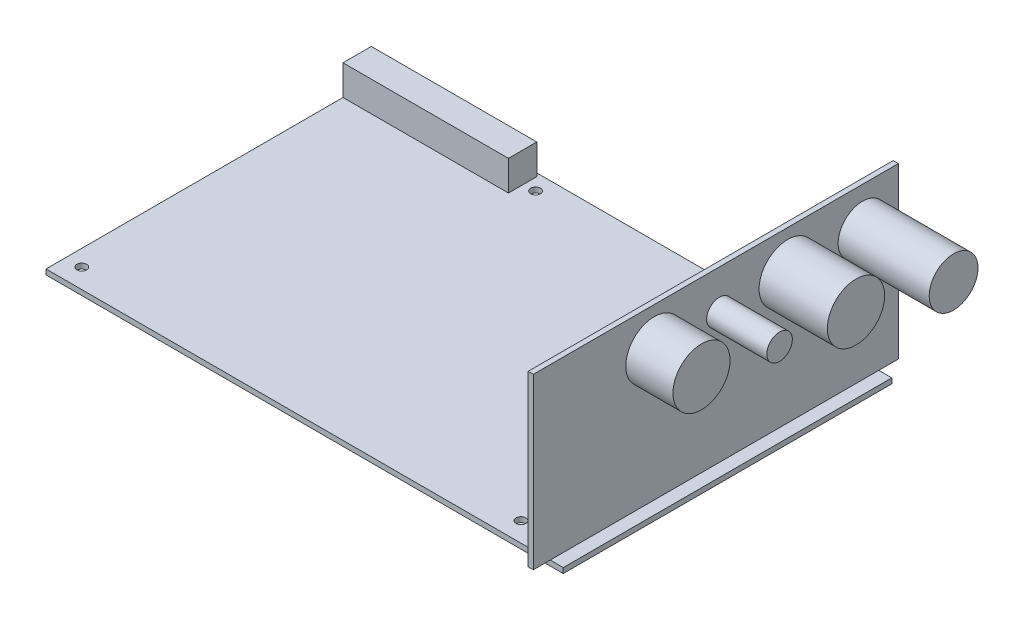
ISO-10303-21;
HEADER;
FILE_DESCRIPTION(('STEP AP214'),'2;1');
FILE_NAME('part.step','',(''),(''),'','','');
FILE_SCHEMA(('AUTOMOTIVE_DESIGN { 1 0 10303 214 1 1 1 1 }'));
ENDSEC;
DATA;
#1=APPLICATION_CONTEXT('core data for automotive mechanical design processes');
#2=APPLICATION_PROTOCOL_DEFINITION('international standard','automotive_design',2000,#1);
#3=PRODUCT_CONTEXT('',#1,'mechanical');
#4=PRODUCT('Part','Part','',(#3));
#5=PRODUCT_RELATED_PRODUCT_CATEGORY('part','',(#4));
#6=PRODUCT_DEFINITION_FORMATION('','',#4);
#7=PRODUCT_DEFINITION_CONTEXT('part definition',#1,'design');
#8=PRODUCT_DEFINITION('design','',#6,#7);
#9=PRODUCT_DEFINITION_SHAPE('','',#8);
#10=(LENGTH_UNIT() NAMED_UNIT(*) SI_UNIT(.MILLI.,.METRE.));
#11=(NAMED_UNIT(*) PLANE_ANGLE_UNIT() SI_UNIT($,.RADIAN.));
#12=(NAMED_UNIT(*) SI_UNIT($,.STERADIAN.) SOLID_ANGLE_UNIT());
#13=UNCERTAINTY_MEASURE_WITH_UNIT(LENGTH_MEASURE(1.E-05),#10,'distance_accuracy_value','');
#14=(GEOMETRIC_REPRESENTATION_CONTEXT(3) GLOBAL_UNCERTAINTY_ASSIGNED_CONTEXT((#13)) GLOBAL_UNIT_ASSIGNED_CONTEXT((#10,
#11,#12)) REPRESENTATION_CONTEXT('',''));
#15=CARTESIAN_POINT('',(0.,0.,0.));
#16=DIRECTION('',(0.,0.,1.));
#17=DIRECTION('',(1.,0.,0.));
#18=AXIS2_PLACEMENT_3D('',#15,#16,#17);
#19=CARTESIAN_POINT('',(0.,1.6,0.));
#20=DIRECTION('',(0.,1.,0.));
#21=DIRECTION('',(0.,0.,1.));
#22=AXIS2_PLACEMENT_3D('',#19,#20,#21);
#23=PLANE('',#22);
#24=CARTESIAN_POINT('',(-74.5,1.6,44.5));
#25=DIRECTION('',(0.,1.,0.));
#26=DIRECTION('',(0.,0.,1.));
#27=AXIS2_PLACEMENT_3D('',#24,#25,#26);
#28=CIRCLE('',#27,1.5);
#29=CARTESIAN_POINT('',(-74.5,1.6,46.));
#30=VERTEX_POINT('',#29);
#31=EDGE_CURVE('E418',#30,#30,#28,.T.);
#32=ORIENTED_EDGE('',*,*,#31,.F.);
#33=EDGE_LOOP('',(#32));
#34=FACE_BOUND('',#33,.T.);
#35=CARTESIAN_POINT('',(-25.,1.6,-45.5));
#36=DIRECTION('',(0.,1.,0.));
#37=DIRECTION('',(0.,0.,1.));
#38=AXIS2_PLACEMENT_3D('',#35,#36,#37);
#39=CIRCLE('',#38,1.5);
#40=CARTESIAN_POINT('',(-25.,1.6,-44.));
#41=VERTEX_POINT('',#40);
#42=EDGE_CURVE('E342',#41,#41,#39,.T.);
#43=ORIENTED_EDGE('',*,*,#42,.F.);
#44=EDGE_LOOP('',(#43));
#45=FACE_BOUND('',#44,.T.);
#46=CARTESIAN_POINT('',(30.5,1.6,-40.5));
#47=DIRECTION('',(0.,1.,0.));
#48=DIRECTION('',(0.,0.,1.));
#49=AXIS2_PLACEMENT_3D('',#46,#47,#48);
#50=CIRCLE('',#49,1.5);
#51=CARTESIAN_POINT('',(30.5,1.6,-39.));
#52=VERTEX_POINT('',#51);
#53=EDGE_CURVE('E349',#52,#52,#50,.T.);
#54=ORIENTED_EDGE('',*,*,#53,.F.);
#55=EDGE_LOOP('',(#54));
#56=FACE_BOUND('',#55,.T.);
#57=CARTESIAN_POINT('',(60.5,1.6,44.5));
#58=DIRECTION('',(0.,1.,0.));
#59=DIRECTION('',(0.,0.,1.));
#60=AXIS2_PLACEMENT_3D('',#57,#58,#59);
#61=CIRCLE('',#60,1.5);
#62=CARTESIAN_POINT('',(60.5,1.6,46.));
#63=VERTEX_POINT('',#62);
#64=EDGE_CURVE('E423',#63,#63,#61,.T.);
#65=ORIENTED_EDGE('',*,*,#64,.F.);
#66=EDGE_LOOP('',(#65));
#67=FACE_BOUND('',#66,.T.);
#68=DIRECTION('',(1.,0.,0.));
#69=VECTOR('',#68,1.);
#70=CARTESIAN_POINT('',(-79.5,1.6,50.5));
#71=LINE('',#70,#69);
#72=CARTESIAN_POINT('',(-79.5,1.6,50.5));
#73=VERTEX_POINT('',#72);
#74=CARTESIAN_POINT('',(73.8999999999999,1.6,50.5));
#75=VERTEX_POINT('',#74);
#76=EDGE_CURVE('E327',#73,#75,#71,.T.);
#77=ORIENTED_EDGE('',*,*,#76,.T.);
#78=DIRECTION('',(0.,0.,1.));
#79=VECTOR('',#78,1.);
#80=CARTESIAN_POINT('',(73.8999999999999,1.6,-56.5));
#81=LINE('',#80,#79);
#82=CARTESIAN_POINT('',(73.8999999999999,1.6,-50.5));
#83=VERTEX_POINT('',#82);
#84=EDGE_CURVE('E48',#83,#75,#81,.T.);
#85=ORIENTED_EDGE('',*,*,#84,.F.);
#86=DIRECTION('',(-1.,0.,0.));
#87=VECTOR('',#86,1.);
#88=CARTESIAN_POINT('',(-79.5,1.6,-50.5));
#89=LINE('',#88,#87);
#90=CARTESIAN_POINT('',(-79.5,1.6,-50.5));
#91=VERTEX_POINT('',#90);
#92=EDGE_CURVE('E355',#83,#91,#89,.T.);
#93=ORIENTED_EDGE('',*,*,#92,.T.);
#94=DIRECTION('',(0.,0.,1.));
#95=VECTOR('',#94,1.);
#96=CARTESIAN_POINT('',(-79.5,1.6,-50.5));
#97=LINE('',#96,#95);
#98=CARTESIAN_POINT('',(-79.5,1.6,-49.5));
#99=VERTEX_POINT('',#98);
#100=EDGE_CURVE('E313',#91,#99,#97,.T.);
#101=ORIENTED_EDGE('',*,*,#100,.T.);
#102=DIRECTION('',(-1.,0.,0.));
#103=VECTOR('',#102,1.);
#104=CARTESIAN_POINT('',(-79.5,1.6,-49.5));
#105=LINE('',#104,#103);
#106=CARTESIAN_POINT('',(-28.63,1.6,-49.5));
#107=VERTEX_POINT('',#106);
#108=EDGE_CURVE('E172',#107,#99,#105,.T.);
#109=ORIENTED_EDGE('',*,*,#108,.F.);
#110=DIRECTION('',(0.,0.,-1.));
#111=VECTOR('',#110,1.);
#112=CARTESIAN_POINT('',(-28.63,1.6,-49.5));
#113=LINE('',#112,#111);
#114=CARTESIAN_POINT('',(-28.63,1.6,-40.79));
#115=VERTEX_POINT('',#114);
#116=EDGE_CURVE('E179',#115,#107,#113,.T.);
#117=ORIENTED_EDGE('',*,*,#116,.F.);
#118=DIRECTION('',(1.,0.,0.));
#119=VECTOR('',#118,1.);
#120=CARTESIAN_POINT('',(-79.5,1.6,-40.79));
#121=LINE('',#120,#119);
#122=CARTESIAN_POINT('',(-79.5,1.6,-40.79));
#123=VERTEX_POINT('',#122);
#124=EDGE_CURVE('E162',#123,#115,#121,.T.);
#125=ORIENTED_EDGE('',*,*,#124,.F.);
#126=EDGE_CURVE('E333',#123,#73,#97,.T.);
#127=ORIENTED_EDGE('',*,*,#126,.T.);
#128=EDGE_LOOP('',(#77,#85,#93,#101,#109,#117,#125,#127));
#129=FACE_BOUND('',#128,.T.);
#130=ADVANCED_FACE('F33',(#34,#45,#56,#67,#129),#23,.T.);
#131=CARTESIAN_POINT('',(79.5,1.6,-50.5));
#132=VERTEX_POINT('',#131);
#133=CARTESIAN_POINT('',(75.4999999999999,1.6,-50.5));
#134=VERTEX_POINT('',#133);
#135=EDGE_CURVE('E338',#132,#134,#89,.T.);
#136=ORIENTED_EDGE('',*,*,#135,.T.);
#137=DIRECTION('',(0.,0.,-1.));
#138=VECTOR('',#137,1.);
#139=CARTESIAN_POINT('',(75.5,1.6,-56.5));
#140=LINE('',#139,#138);
#141=CARTESIAN_POINT('',(75.5,1.6,50.5));
#142=VERTEX_POINT('',#141);
#143=EDGE_CURVE('E222',#142,#134,#140,.T.);
#144=ORIENTED_EDGE('',*,*,#143,.F.);
#145=CARTESIAN_POINT('',(79.5,1.6,50.5));
#146=VERTEX_POINT('',#145);
#147=EDGE_CURVE('E332',#142,#146,#71,.T.);
#148=ORIENTED_EDGE('',*,*,#147,.T.);
#149=DIRECTION('',(0.,0.,-1.));
#150=VECTOR('',#149,1.);
#151=CARTESIAN_POINT('',(79.5,1.6,-50.5));
#152=LINE('',#151,#150);
#153=EDGE_CURVE('E320',#146,#132,#152,.T.);
#154=ORIENTED_EDGE('',*,*,#153,.T.);
#155=EDGE_LOOP('',(#136,#144,#148,#154));
#156=FACE_BOUND('',#155,.T.);
#157=ADVANCED_FACE('F268',(#156),#23,.T.);
#158=CARTESIAN_POINT('',(0.,0.,0.));
#159=DIRECTION('',(0.,1.,0.));
#160=DIRECTION('',(0.,0.,1.));
#161=AXIS2_PLACEMENT_3D('',#158,#159,#160);
#162=PLANE('',#161);
#163=DIRECTION('',(0.,0.,-1.));
#164=VECTOR('',#163,1.);
#165=CARTESIAN_POINT('',(79.5,0.,-50.5));
#166=LINE('',#165,#164);
#167=CARTESIAN_POINT('',(79.5,0.,50.5));
#168=VERTEX_POINT('',#167);
#169=CARTESIAN_POINT('',(79.5,0.,-50.5));
#170=VERTEX_POINT('',#169);
#171=EDGE_CURVE('E309',#168,#170,#166,.T.);
#172=ORIENTED_EDGE('',*,*,#171,.F.);
#173=DIRECTION('',(1.,0.,0.));
#174=VECTOR('',#173,1.);
#175=CARTESIAN_POINT('',(-79.5,0.,50.5));
#176=LINE('',#175,#174);
#177=CARTESIAN_POINT('',(-79.5,0.,50.5));
#178=VERTEX_POINT('',#177);
#179=EDGE_CURVE('E318',#178,#168,#176,.T.);
#180=ORIENTED_EDGE('',*,*,#179,.F.);
#181=DIRECTION('',(0.,0.,1.));
#182=VECTOR('',#181,1.);
#183=CARTESIAN_POINT('',(-79.5,0.,-50.5));
#184=LINE('',#183,#182);
#185=CARTESIAN_POINT('',(-79.5,0.,-50.5));
#186=VERTEX_POINT('',#185);
#187=EDGE_CURVE('E308',#186,#178,#184,.T.);
#188=ORIENTED_EDGE('',*,*,#187,.F.);
#189=DIRECTION('',(-1.,0.,0.));
#190=VECTOR('',#189,1.);
#191=CARTESIAN_POINT('',(-79.5,0.,-50.5));
#192=LINE('',#191,#190);
#193=EDGE_CURVE('E300',#170,#186,#192,.T.);
#194=ORIENTED_EDGE('',*,*,#193,.F.);
#195=EDGE_LOOP('',(#172,#180,#188,#194));
#196=FACE_BOUND('',#195,.T.);
#197=CARTESIAN_POINT('',(-25.,0.,-45.5));
#198=DIRECTION('',(0.,1.,0.));
#199=DIRECTION('',(0.,0.,1.));
#200=AXIS2_PLACEMENT_3D('',#197,#198,#199);
#201=CIRCLE('',#200,1.5);
#202=CARTESIAN_POINT('',(-25.,0.,-44.));
#203=VERTEX_POINT('',#202);
#204=EDGE_CURVE('E344',#203,#203,#201,.T.);
#205=ORIENTED_EDGE('',*,*,#204,.T.);
#206=EDGE_LOOP('',(#205));
#207=FACE_BOUND('',#206,.T.);
#208=CARTESIAN_POINT('',(30.5,0.,-40.5));
#209=DIRECTION('',(0.,1.,0.));
#210=DIRECTION('',(0.,0.,1.));
#211=AXIS2_PLACEMENT_3D('',#208,#209,#210);
#212=CIRCLE('',#211,1.5);
#213=CARTESIAN_POINT('',(30.5,0.,-39.));
#214=VERTEX_POINT('',#213);
#215=EDGE_CURVE('E352',#214,#214,#212,.T.);
#216=ORIENTED_EDGE('',*,*,#215,.T.);
#217=EDGE_LOOP('',(#216));
#218=FACE_BOUND('',#217,.T.);
#219=CARTESIAN_POINT('',(-74.5,0.,44.5));
#220=DIRECTION('',(0.,1.,0.));
#221=DIRECTION('',(0.,0.,1.));
#222=AXIS2_PLACEMENT_3D('',#219,#220,#221);
#223=CIRCLE('',#222,1.5);
#224=CARTESIAN_POINT('',(-74.5,0.,46.));
#225=VERTEX_POINT('',#224);
#226=EDGE_CURVE('E420',#225,#225,#223,.T.);
#227=ORIENTED_EDGE('',*,*,#226,.T.);
#228=EDGE_LOOP('',(#227));
#229=FACE_BOUND('',#228,.T.);
#230=CARTESIAN_POINT('',(60.5,0.,44.5));
#231=DIRECTION('',(0.,1.,0.));
#232=DIRECTION('',(0.,0.,1.));
#233=AXIS2_PLACEMENT_3D('',#230,#231,#232);
#234=CIRCLE('',#233,1.5);
#235=CARTESIAN_POINT('',(60.5,0.,46.));
#236=VERTEX_POINT('',#235);
#237=EDGE_CURVE('E426',#236,#236,#234,.T.);
#238=ORIENTED_EDGE('',*,*,#237,.T.);
#239=EDGE_LOOP('',(#238));
#240=FACE_BOUND('',#239,.T.);
#241=ADVANCED_FACE('F274',(#196,#207,#218,#229,#240),#162,.F.);
#242=CARTESIAN_POINT('',(79.5,1.6,-50.5));
#243=DIRECTION('',(-1.,0.,0.));
#244=DIRECTION('',(0.,0.,1.));
#245=AXIS2_PLACEMENT_3D('',#242,#243,#244);
#246=PLANE('',#245);
#247=ORIENTED_EDGE('',*,*,#171,.T.);
#248=DIRECTION('',(0.,-1.,0.));
#249=VECTOR('',#248,1.);
#250=CARTESIAN_POINT('',(79.5,1.6,-50.5));
#251=LINE('',#250,#249);
#252=EDGE_CURVE('E200',#132,#170,#251,.T.);
#253=ORIENTED_EDGE('',*,*,#252,.F.);
#254=ORIENTED_EDGE('',*,*,#153,.F.);
#255=DIRECTION('',(0.,-1.,0.));
#256=VECTOR('',#255,1.);
#257=CARTESIAN_POINT('',(79.5,1.6,50.5));
#258=LINE('',#257,#256);
#259=EDGE_CURVE('E324',#146,#168,#258,.T.);
#260=ORIENTED_EDGE('',*,*,#259,.T.);
#261=EDGE_LOOP('',(#247,#253,#254,#260));
#262=FACE_BOUND('',#261,.T.);
#263=ADVANCED_FACE('F35',(#262),#246,.F.);
#264=CARTESIAN_POINT('',(-79.5,1.6,-50.5));
#265=DIRECTION('',(0.,0.,1.));
#266=DIRECTION('',(1.,0.,0.));
#267=AXIS2_PLACEMENT_3D('',#264,#265,#266);
#268=PLANE('',#267);
#269=ORIENTED_EDGE('',*,*,#193,.T.);
#270=DIRECTION('',(0.,-1.,0.));
#271=VECTOR('',#270,1.);
#272=CARTESIAN_POINT('',(-79.5,1.6,-50.5));
#273=LINE('',#272,#271);
#274=EDGE_CURVE('E302',#91,#186,#273,.T.);
#275=ORIENTED_EDGE('',*,*,#274,.F.);
#276=ORIENTED_EDGE('',*,*,#92,.F.);
#277=DIRECTION('',(-1.,0.,0.));
#278=VECTOR('',#277,1.);
#279=CARTESIAN_POINT('',(-79.5,1.6,-50.5));
#280=LINE('',#279,#278);
#281=EDGE_CURVE('E55',#134,#83,#280,.T.);
#282=ORIENTED_EDGE('',*,*,#281,.F.);
#283=ORIENTED_EDGE('',*,*,#135,.F.);
#284=ORIENTED_EDGE('',*,*,#252,.T.);
#285=EDGE_LOOP('',(#269,#275,#276,#282,#283,#284));
#286=FACE_BOUND('',#285,.T.);
#287=ADVANCED_FACE('F291',(#286),#268,.F.);
#288=CARTESIAN_POINT('',(-79.5,1.6,-50.5));
#289=DIRECTION('',(1.,0.,0.));
#290=DIRECTION('',(0.,0.,-1.));
#291=AXIS2_PLACEMENT_3D('',#288,#289,#290);
#292=PLANE('',#291);
#293=ORIENTED_EDGE('',*,*,#187,.T.);
#294=DIRECTION('',(0.,-1.,0.));
#295=VECTOR('',#294,1.);
#296=CARTESIAN_POINT('',(-79.5,1.6,50.5));
#297=LINE('',#296,#295);
#298=EDGE_CURVE('E314',#73,#178,#297,.T.);
#299=ORIENTED_EDGE('',*,*,#298,.F.);
#300=ORIENTED_EDGE('',*,*,#126,.F.);
#301=DIRECTION('',(0.,-1.,0.));
#302=VECTOR('',#301,1.);
#303=CARTESIAN_POINT('',(-79.5,10.84,-40.79));
#304=LINE('',#303,#302);
#305=CARTESIAN_POINT('',(-79.5,10.84,-40.79));
#306=VERTEX_POINT('',#305);
#307=EDGE_CURVE('E429',#306,#123,#304,.T.);
#308=ORIENTED_EDGE('',*,*,#307,.F.);
#309=DIRECTION('',(0.,0.,1.));
#310=VECTOR('',#309,1.);
#311=CARTESIAN_POINT('',(-79.5,10.84,-49.5));
#312=LINE('',#311,#310);
#313=CARTESIAN_POINT('',(-79.5,10.84,-49.5));
#314=VERTEX_POINT('',#313);
#315=EDGE_CURVE('E168',#314,#306,#312,.T.);
#316=ORIENTED_EDGE('',*,*,#315,.F.);
#317=DIRECTION('',(0.,-1.,0.));
#318=VECTOR('',#317,1.);
#319=CARTESIAN_POINT('',(-79.5,10.84,-49.5));
#320=LINE('',#319,#318);
#321=EDGE_CURVE('E178',#314,#99,#320,.T.);
#322=ORIENTED_EDGE('',*,*,#321,.T.);
#323=ORIENTED_EDGE('',*,*,#100,.F.);
#324=ORIENTED_EDGE('',*,*,#274,.T.);
#325=EDGE_LOOP('',(#293,#299,#300,#308,#316,#322,#323,#324));
#326=FACE_BOUND('',#325,.T.);
#327=ADVANCED_FACE('F288',(#326),#292,.F.);
#328=CARTESIAN_POINT('',(-79.5,1.6,50.5));
#329=DIRECTION('',(0.,0.,-1.));
#330=DIRECTION('',(-1.,0.,0.));
#331=AXIS2_PLACEMENT_3D('',#328,#329,#330);
#332=PLANE('',#331);
#333=ORIENTED_EDGE('',*,*,#179,.T.);
#334=ORIENTED_EDGE('',*,*,#259,.F.);
#335=ORIENTED_EDGE('',*,*,#147,.F.);
#336=EDGE_CURVE('E341',#75,#142,#71,.T.);
#337=ORIENTED_EDGE('',*,*,#336,.F.);
#338=ORIENTED_EDGE('',*,*,#76,.F.);
#339=ORIENTED_EDGE('',*,*,#298,.T.);
#340=EDGE_LOOP('',(#333,#334,#335,#337,#338,#339));
#341=FACE_BOUND('',#340,.T.);
#342=ADVANCED_FACE('F285',(#341),#332,.F.);
#343=CARTESIAN_POINT('',(-25.,1.6,-45.5));
#344=DIRECTION('',(0.,-1.,0.));
#345=DIRECTION('',(0.,0.,-1.));
#346=AXIS2_PLACEMENT_3D('',#343,#344,#345);
#347=CYLINDRICAL_SURFACE('',#346,1.5);
#348=ORIENTED_EDGE('',*,*,#42,.T.);
#349=EDGE_LOOP('',(#348));
#350=FACE_BOUND('',#349,.T.);
#351=ORIENTED_EDGE('',*,*,#204,.F.);
#352=EDGE_LOOP('',(#351));
#353=FACE_BOUND('',#352,.T.);
#354=ADVANCED_FACE('F280',(#350,#353),#347,.F.);
#355=CARTESIAN_POINT('',(30.5,1.6,-40.5));
#356=DIRECTION('',(0.,-1.,0.));
#357=DIRECTION('',(0.,0.,-1.));
#358=AXIS2_PLACEMENT_3D('',#355,#356,#357);
#359=CYLINDRICAL_SURFACE('',#358,1.5);
#360=ORIENTED_EDGE('',*,*,#53,.T.);
#361=EDGE_LOOP('',(#360));
#362=FACE_BOUND('',#361,.T.);
#363=ORIENTED_EDGE('',*,*,#215,.F.);
#364=EDGE_LOOP('',(#363));
#365=FACE_BOUND('',#364,.T.);
#366=ADVANCED_FACE('F405',(#362,#365),#359,.F.);
#367=CARTESIAN_POINT('',(-74.5,1.6,44.5));
#368=DIRECTION('',(0.,-1.,0.));
#369=DIRECTION('',(0.,0.,-1.));
#370=AXIS2_PLACEMENT_3D('',#367,#368,#369);
#371=CYLINDRICAL_SURFACE('',#370,1.5);
#372=ORIENTED_EDGE('',*,*,#31,.T.);
#373=EDGE_LOOP('',(#372));
#374=FACE_BOUND('',#373,.T.);
#375=ORIENTED_EDGE('',*,*,#226,.F.);
#376=EDGE_LOOP('',(#375));
#377=FACE_BOUND('',#376,.T.);
#378=ADVANCED_FACE('F402',(#374,#377),#371,.F.);
#379=CARTESIAN_POINT('',(60.5,1.6,44.5));
#380=DIRECTION('',(0.,-1.,0.));
#381=DIRECTION('',(0.,0.,-1.));
#382=AXIS2_PLACEMENT_3D('',#379,#380,#381);
#383=CYLINDRICAL_SURFACE('',#382,1.5);
#384=ORIENTED_EDGE('',*,*,#64,.T.);
#385=EDGE_LOOP('',(#384));
#386=FACE_BOUND('',#385,.T.);
#387=ORIENTED_EDGE('',*,*,#237,.F.);
#388=EDGE_LOOP('',(#387));
#389=FACE_BOUND('',#388,.T.);
#390=ADVANCED_FACE('F398',(#386,#389),#383,.F.);
#391=CARTESIAN_POINT('',(-79.5,10.84,-40.79));
#392=DIRECTION('',(0.,0.,-1.));
#393=DIRECTION('',(-1.,0.,0.));
#394=AXIS2_PLACEMENT_3D('',#391,#392,#393);
#395=PLANE('',#394);
#396=ORIENTED_EDGE('',*,*,#124,.T.);
#397=DIRECTION('',(0.,-1.,0.));
#398=VECTOR('',#397,1.);
#399=CARTESIAN_POINT('',(-28.63,10.84,-40.79));
#400=LINE('',#399,#398);
#401=CARTESIAN_POINT('',(-28.63,10.84,-40.79));
#402=VERTEX_POINT('',#401);
#403=EDGE_CURVE('E431',#402,#115,#400,.T.);
#404=ORIENTED_EDGE('',*,*,#403,.F.);
#405=DIRECTION('',(1.,0.,0.));
#406=VECTOR('',#405,1.);
#407=CARTESIAN_POINT('',(-79.5,10.84,-40.79));
#408=LINE('',#407,#406);
#409=EDGE_CURVE('E171',#306,#402,#408,.T.);
#410=ORIENTED_EDGE('',*,*,#409,.F.);
#411=ORIENTED_EDGE('',*,*,#307,.T.);
#412=EDGE_LOOP('',(#396,#404,#410,#411));
#413=FACE_BOUND('',#412,.T.);
#414=ADVANCED_FACE('F394',(#413),#395,.F.);
#415=CARTESIAN_POINT('',(-28.63,10.84,-49.5));
#416=DIRECTION('',(-1.,0.,0.));
#417=DIRECTION('',(0.,0.,1.));
#418=AXIS2_PLACEMENT_3D('',#415,#416,#417);
#419=PLANE('',#418);
#420=ORIENTED_EDGE('',*,*,#116,.T.);
#421=DIRECTION('',(0.,-1.,0.));
#422=VECTOR('',#421,1.);
#423=CARTESIAN_POINT('',(-28.63,10.84,-49.5));
#424=LINE('',#423,#422);
#425=CARTESIAN_POINT('',(-28.63,10.84,-49.5));
#426=VERTEX_POINT('',#425);
#427=EDGE_CURVE('E184',#426,#107,#424,.T.);
#428=ORIENTED_EDGE('',*,*,#427,.F.);
#429=DIRECTION('',(0.,0.,-1.));
#430=VECTOR('',#429,1.);
#431=CARTESIAN_POINT('',(-28.63,10.84,-49.5));
#432=LINE('',#431,#430);
#433=EDGE_CURVE('E174',#402,#426,#432,.T.);
#434=ORIENTED_EDGE('',*,*,#433,.F.);
#435=ORIENTED_EDGE('',*,*,#403,.T.);
#436=EDGE_LOOP('',(#420,#428,#434,#435));
#437=FACE_BOUND('',#436,.T.);
#438=ADVANCED_FACE('F390',(#437),#419,.F.);
#439=CARTESIAN_POINT('',(-79.5,10.84,-49.5));
#440=DIRECTION('',(0.,0.,1.));
#441=DIRECTION('',(1.,0.,0.));
#442=AXIS2_PLACEMENT_3D('',#439,#440,#441);
#443=PLANE('',#442);
#444=ORIENTED_EDGE('',*,*,#108,.T.);
#445=ORIENTED_EDGE('',*,*,#321,.F.);
#446=DIRECTION('',(-1.,0.,0.));
#447=VECTOR('',#446,1.);
#448=CARTESIAN_POINT('',(-79.5,10.84,-49.5));
#449=LINE('',#448,#447);
#450=EDGE_CURVE('E176',#426,#314,#449,.T.);
#451=ORIENTED_EDGE('',*,*,#450,.F.);
#452=ORIENTED_EDGE('',*,*,#427,.T.);
#453=EDGE_LOOP('',(#444,#445,#451,#452));
#454=FACE_BOUND('',#453,.T.);
#455=ADVANCED_FACE('F386',(#454),#443,.F.);
#456=CARTESIAN_POINT('',(0.,10.84,0.));
#457=DIRECTION('',(0.,1.,0.));
#458=DIRECTION('',(0.,0.,1.));
#459=AXIS2_PLACEMENT_3D('',#456,#457,#458);
#460=PLANE('',#459);
#461=ORIENTED_EDGE('',*,*,#315,.T.);
#462=ORIENTED_EDGE('',*,*,#409,.T.);
#463=ORIENTED_EDGE('',*,*,#433,.T.);
#464=ORIENTED_EDGE('',*,*,#450,.T.);
#465=EDGE_LOOP('',(#461,#462,#463,#464));
#466=FACE_BOUND('',#465,.T.);
#467=ADVANCED_FACE('F383',(#466),#460,.T.);
#468=CARTESIAN_POINT('',(0.,1.6,0.));
#469=DIRECTION('',(0.,1.,0.));
#470=DIRECTION('',(0.,0.,1.));
#471=AXIS2_PLACEMENT_3D('',#468,#469,#470);
#472=PLANE('',#471);
#473=CARTESIAN_POINT('',(75.5,1.6,-56.5));
#474=VERTEX_POINT('',#473);
#475=EDGE_CURVE('E226',#134,#474,#140,.T.);
#476=ORIENTED_EDGE('',*,*,#475,.F.);
#477=ORIENTED_EDGE('',*,*,#281,.T.);
#478=CARTESIAN_POINT('',(73.8999999999999,1.6,-56.5));
#479=VERTEX_POINT('',#478);
#480=EDGE_CURVE('E233',#479,#83,#81,.T.);
#481=ORIENTED_EDGE('',*,*,#480,.F.);
#482=DIRECTION('',(-1.,0.,0.));
#483=VECTOR('',#482,1.);
#484=CARTESIAN_POINT('',(73.8999999999999,1.6,-56.5));
#485=LINE('',#484,#483);
#486=EDGE_CURVE('E154',#474,#479,#485,.T.);
#487=ORIENTED_EDGE('',*,*,#486,.F.);
#488=EDGE_LOOP('',(#476,#477,#481,#487));
#489=FACE_BOUND('',#488,.T.);
#490=ADVANCED_FACE('F367',(#489),#472,.F.);
#491=CARTESIAN_POINT('',(73.8999999999999,1.6,55.7));
#492=VERTEX_POINT('',#491);
#493=EDGE_CURVE('E159',#75,#492,#81,.T.);
#494=ORIENTED_EDGE('',*,*,#493,.F.);
#495=ORIENTED_EDGE('',*,*,#336,.T.);
#496=CARTESIAN_POINT('',(75.5,1.6,55.7));
#497=VERTEX_POINT('',#496);
#498=EDGE_CURVE('E220',#497,#142,#140,.T.);
#499=ORIENTED_EDGE('',*,*,#498,.F.);
#500=DIRECTION('',(1.,0.,0.));
#501=VECTOR('',#500,1.);
#502=CARTESIAN_POINT('',(73.8999999999999,1.6,55.7));
#503=LINE('',#502,#501);
#504=EDGE_CURVE('E229',#492,#497,#503,.T.);
#505=ORIENTED_EDGE('',*,*,#504,.F.);
#506=EDGE_LOOP('',(#494,#495,#499,#505));
#507=FACE_BOUND('',#506,.T.);
#508=ADVANCED_FACE('F363',(#507),#472,.F.);
#509=CARTESIAN_POINT('',(73.8999999999999,53.64,-56.5));
#510=DIRECTION('',(1.,0.,0.));
#511=DIRECTION('',(0.,0.,-1.));
#512=AXIS2_PLACEMENT_3D('',#509,#510,#511);
#513=PLANE('',#512);
#514=ORIENTED_EDGE('',*,*,#480,.T.);
#515=ORIENTED_EDGE('',*,*,#84,.T.);
#516=ORIENTED_EDGE('',*,*,#493,.T.);
#517=DIRECTION('',(0.,-1.,0.));
#518=VECTOR('',#517,1.);
#519=CARTESIAN_POINT('',(73.8999999999999,53.64,55.7));
#520=LINE('',#519,#518);
#521=CARTESIAN_POINT('',(73.8999999999999,53.64,55.7));
#522=VERTEX_POINT('',#521);
#523=EDGE_CURVE('E139',#522,#492,#520,.T.);
#524=ORIENTED_EDGE('',*,*,#523,.F.);
#525=DIRECTION('',(0.,0.,1.));
#526=VECTOR('',#525,1.);
#527=CARTESIAN_POINT('',(73.8999999999999,53.64,-56.5));
#528=LINE('',#527,#526);
#529=CARTESIAN_POINT('',(73.8999999999999,53.64,-56.5));
#530=VERTEX_POINT('',#529);
#531=EDGE_CURVE('E145',#530,#522,#528,.T.);
#532=ORIENTED_EDGE('',*,*,#531,.F.);
#533=DIRECTION('',(0.,-1.,0.));
#534=VECTOR('',#533,1.);
#535=CARTESIAN_POINT('',(73.8999999999999,53.64,-56.5));
#536=LINE('',#535,#534);
#537=EDGE_CURVE('E237',#530,#479,#536,.T.);
#538=ORIENTED_EDGE('',*,*,#537,.T.);
#539=EDGE_LOOP('',(#514,#515,#516,#524,#532,#538));
#540=FACE_BOUND('',#539,.T.);
#541=ADVANCED_FACE('F157',(#540),#513,.F.);
#542=CARTESIAN_POINT('',(73.8999999999999,53.64,55.7));
#543=DIRECTION('',(0.,0.,-1.));
#544=DIRECTION('',(-1.,0.,0.));
#545=AXIS2_PLACEMENT_3D('',#542,#543,#544);
#546=PLANE('',#545);
#547=ORIENTED_EDGE('',*,*,#504,.T.);
#548=DIRECTION('',(0.,-1.,0.));
#549=VECTOR('',#548,1.);
#550=CARTESIAN_POINT('',(75.5,53.64,55.7));
#551=LINE('',#550,#549);
#552=CARTESIAN_POINT('',(75.5,53.64,55.7));
#553=VERTEX_POINT('',#552);
#554=EDGE_CURVE('E141',#553,#497,#551,.T.);
#555=ORIENTED_EDGE('',*,*,#554,.F.);
#556=DIRECTION('',(1.,0.,0.));
#557=VECTOR('',#556,1.);
#558=CARTESIAN_POINT('',(73.8999999999999,53.64,55.7));
#559=LINE('',#558,#557);
#560=EDGE_CURVE('E135',#522,#553,#559,.T.);
#561=ORIENTED_EDGE('',*,*,#560,.F.);
#562=ORIENTED_EDGE('',*,*,#523,.T.);
#563=EDGE_LOOP('',(#547,#555,#561,#562));
#564=FACE_BOUND('',#563,.T.);
#565=ADVANCED_FACE('F137',(#564),#546,.F.);
#566=CARTESIAN_POINT('',(75.5,53.64,-56.5));
#567=DIRECTION('',(-1.,0.,0.));
#568=DIRECTION('',(0.,0.,1.));
#569=AXIS2_PLACEMENT_3D('',#566,#567,#568);
#570=PLANE('',#569);
#571=CARTESIAN_POINT('',(75.5,41.64,18.5));
#572=DIRECTION('',(-1.,0.,0.));
#573=DIRECTION('',(0.,0.,1.));
#574=AXIS2_PLACEMENT_3D('',#571,#572,#573);
#575=CIRCLE('',#574,8.775);
#576=CARTESIAN_POINT('',(75.5,41.64,27.275));
#577=VERTEX_POINT('',#576);
#578=EDGE_CURVE('E11',#577,#577,#575,.F.);
#579=ORIENTED_EDGE('',*,*,#578,.F.);
#580=EDGE_LOOP('',(#579));
#581=FACE_BOUND('',#580,.T.);
#582=CARTESIAN_POINT('',(75.5,41.64,-1.5));
#583=DIRECTION('',(-1.,0.,0.));
#584=DIRECTION('',(0.,0.,1.));
#585=AXIS2_PLACEMENT_3D('',#582,#583,#584);
#586=CIRCLE('',#585,3.93);
#587=CARTESIAN_POINT('',(75.5,41.64,2.43));
#588=VERTEX_POINT('',#587);
#589=EDGE_CURVE('E41',#588,#588,#586,.F.);
#590=ORIENTED_EDGE('',*,*,#589,.F.);
#591=EDGE_LOOP('',(#590));
#592=FACE_BOUND('',#591,.T.);
#593=CARTESIAN_POINT('',(75.5,41.64,-22.5));
#594=DIRECTION('',(-1.,0.,0.));
#595=DIRECTION('',(0.,0.,1.));
#596=AXIS2_PLACEMENT_3D('',#593,#594,#595);
#597=CIRCLE('',#596,8.8);
#598=CARTESIAN_POINT('',(75.5,41.64,-13.7));
#599=VERTEX_POINT('',#598);
#600=EDGE_CURVE('E199',#599,#599,#597,.F.);
#601=ORIENTED_EDGE('',*,*,#600,.F.);
#602=EDGE_LOOP('',(#601));
#603=FACE_BOUND('',#602,.T.);
#604=CARTESIAN_POINT('',(75.5,41.64,-45.5));
#605=DIRECTION('',(-1.,0.,0.));
#606=DIRECTION('',(0.,0.,1.));
#607=AXIS2_PLACEMENT_3D('',#604,#605,#606);
#608=CIRCLE('',#607,7.5);
#609=CARTESIAN_POINT('',(75.5,41.64,-38.));
#610=VERTEX_POINT('',#609);
#611=EDGE_CURVE('E196',#610,#610,#608,.F.);
#612=ORIENTED_EDGE('',*,*,#611,.F.);
#613=EDGE_LOOP('',(#612));
#614=FACE_BOUND('',#613,.T.);
#615=ORIENTED_EDGE('',*,*,#498,.T.);
#616=ORIENTED_EDGE('',*,*,#143,.T.);
#617=ORIENTED_EDGE('',*,*,#475,.T.);
#618=DIRECTION('',(0.,-1.,0.));
#619=VECTOR('',#618,1.);
#620=CARTESIAN_POINT('',(75.5,53.64,-56.5));
#621=LINE('',#620,#619);
#622=CARTESIAN_POINT('',(75.5,53.64,-56.5));
#623=VERTEX_POINT('',#622);
#624=EDGE_CURVE('E164',#623,#474,#621,.T.);
#625=ORIENTED_EDGE('',*,*,#624,.F.);
#626=DIRECTION('',(0.,0.,-1.));
#627=VECTOR('',#626,1.);
#628=CARTESIAN_POINT('',(75.5,53.64,-56.5));
#629=LINE('',#628,#627);
#630=EDGE_CURVE('E144',#553,#623,#629,.T.);
#631=ORIENTED_EDGE('',*,*,#630,.F.);
#632=ORIENTED_EDGE('',*,*,#554,.T.);
#633=EDGE_LOOP('',(#615,#616,#617,#625,#631,#632));
#634=FACE_BOUND('',#633,.T.);
#635=ADVANCED_FACE('F207',(#581,#592,#603,#614,#634),#570,.F.);
#636=CARTESIAN_POINT('',(73.8999999999999,53.64,-56.5));
#637=DIRECTION('',(0.,0.,1.));
#638=DIRECTION('',(1.,0.,0.));
#639=AXIS2_PLACEMENT_3D('',#636,#637,#638);
#640=PLANE('',#639);
#641=ORIENTED_EDGE('',*,*,#486,.T.);
#642=ORIENTED_EDGE('',*,*,#537,.F.);
#643=DIRECTION('',(-1.,0.,0.));
#644=VECTOR('',#643,1.);
#645=CARTESIAN_POINT('',(73.8999999999999,53.64,-56.5));
#646=LINE('',#645,#644);
#647=EDGE_CURVE('E150',#623,#530,#646,.T.);
#648=ORIENTED_EDGE('',*,*,#647,.F.);
#649=ORIENTED_EDGE('',*,*,#624,.T.);
#650=EDGE_LOOP('',(#641,#642,#648,#649));
#651=FACE_BOUND('',#650,.T.);
#652=ADVANCED_FACE('F210',(#651),#640,.F.);
#653=CARTESIAN_POINT('',(0.,53.64,0.));
#654=DIRECTION('',(0.,1.,0.));
#655=DIRECTION('',(0.,0.,1.));
#656=AXIS2_PLACEMENT_3D('',#653,#654,#655);
#657=PLANE('',#656);
#658=ORIENTED_EDGE('',*,*,#531,.T.);
#659=ORIENTED_EDGE('',*,*,#560,.T.);
#660=ORIENTED_EDGE('',*,*,#630,.T.);
#661=ORIENTED_EDGE('',*,*,#647,.T.);
#662=EDGE_LOOP('',(#658,#659,#660,#661));
#663=FACE_BOUND('',#662,.T.);
#664=ADVANCED_FACE('F148',(#663),#657,.T.);
#665=CARTESIAN_POINT('',(103.5,41.64,-45.5));
#666=DIRECTION('',(-1.,0.,0.));
#667=DIRECTION('',(0.,0.,1.));
#668=AXIS2_PLACEMENT_3D('',#665,#666,#667);
#669=CYLINDRICAL_SURFACE('',#668,7.5);
#670=CARTESIAN_POINT('',(103.5,41.64,-45.5));
#671=DIRECTION('',(1.,0.,0.));
#672=DIRECTION('',(0.,0.,-1.));
#673=AXIS2_PLACEMENT_3D('',#670,#671,#672);
#674=CIRCLE('',#673,7.5);
#675=CARTESIAN_POINT('',(103.5,41.64,-53.));
#676=VERTEX_POINT('',#675);
#677=EDGE_CURVE('E239',#676,#676,#674,.T.);
#678=ORIENTED_EDGE('',*,*,#677,.F.);
#679=EDGE_LOOP('',(#678));
#680=FACE_BOUND('',#679,.T.);
#681=ORIENTED_EDGE('',*,*,#611,.T.);
#682=EDGE_LOOP('',(#681));
#683=FACE_BOUND('',#682,.T.);
#684=ADVANCED_FACE('F375',(#680,#683),#669,.T.);
#685=CARTESIAN_POINT('',(103.5,41.64,-45.5));
#686=DIRECTION('',(1.,0.,0.));
#687=DIRECTION('',(0.,0.,-1.));
#688=AXIS2_PLACEMENT_3D('',#685,#686,#687);
#689=PLANE('',#688);
#690=ORIENTED_EDGE('',*,*,#677,.T.);
#691=EDGE_LOOP('',(#690));
#692=FACE_BOUND('',#691,.T.);
#693=ADVANCED_FACE('F583',(#692),#689,.T.);
#694=CARTESIAN_POINT('',(96.5,41.64,-22.5));
#695=DIRECTION('',(-1.,0.,0.));
#696=DIRECTION('',(0.,0.,1.));
#697=AXIS2_PLACEMENT_3D('',#694,#695,#696);
#698=CYLINDRICAL_SURFACE('',#697,8.8);
#699=CARTESIAN_POINT('',(96.5,41.64,-22.5));
#700=DIRECTION('',(1.,0.,0.));
#701=DIRECTION('',(0.,0.,-1.));
#702=AXIS2_PLACEMENT_3D('',#699,#700,#701);
#703=CIRCLE('',#702,8.8);
#704=CARTESIAN_POINT('',(96.5,41.64,-31.3));
#705=VERTEX_POINT('',#704);
#706=EDGE_CURVE('E242',#705,#705,#703,.T.);
#707=ORIENTED_EDGE('',*,*,#706,.F.);
#708=EDGE_LOOP('',(#707));
#709=FACE_BOUND('',#708,.T.);
#710=ORIENTED_EDGE('',*,*,#600,.T.);
#711=EDGE_LOOP('',(#710));
#712=FACE_BOUND('',#711,.T.);
#713=ADVANCED_FACE('F592',(#709,#712),#698,.T.);
#714=CARTESIAN_POINT('',(96.5,41.64,-22.5));
#715=DIRECTION('',(1.,0.,0.));
#716=DIRECTION('',(0.,0.,-1.));
#717=AXIS2_PLACEMENT_3D('',#714,#715,#716);
#718=PLANE('',#717);
#719=ORIENTED_EDGE('',*,*,#706,.T.);
#720=EDGE_LOOP('',(#719));
#721=FACE_BOUND('',#720,.T.);
#722=ADVANCED_FACE('F601',(#721),#718,.T.);
#723=CARTESIAN_POINT('',(94.,41.64,-1.5));
#724=DIRECTION('',(-1.,0.,0.));
#725=DIRECTION('',(0.,0.,1.));
#726=AXIS2_PLACEMENT_3D('',#723,#724,#725);
#727=CYLINDRICAL_SURFACE('',#726,3.93);
#728=CARTESIAN_POINT('',(94.,41.64,-1.5));
#729=DIRECTION('',(1.,0.,0.));
#730=DIRECTION('',(0.,0.,-1.));
#731=AXIS2_PLACEMENT_3D('',#728,#729,#730);
#732=CIRCLE('',#731,3.93);
#733=CARTESIAN_POINT('',(94.,41.64,-5.43));
#734=VERTEX_POINT('',#733);
#735=EDGE_CURVE('E245',#734,#734,#732,.T.);
#736=ORIENTED_EDGE('',*,*,#735,.F.);
#737=EDGE_LOOP('',(#736));
#738=FACE_BOUND('',#737,.T.);
#739=ORIENTED_EDGE('',*,*,#589,.T.);
#740=EDGE_LOOP('',(#739));
#741=FACE_BOUND('',#740,.T.);
#742=ADVANCED_FACE('F205',(#738,#741),#727,.T.);
#743=CARTESIAN_POINT('',(94.,41.64,-1.5));
#744=DIRECTION('',(1.,0.,0.));
#745=DIRECTION('',(0.,0.,-1.));
#746=AXIS2_PLACEMENT_3D('',#743,#744,#745);
#747=PLANE('',#746);
#748=ORIENTED_EDGE('',*,*,#735,.T.);
#749=EDGE_LOOP('',(#748));
#750=FACE_BOUND('',#749,.T.);
#751=ADVANCED_FACE('F257',(#750),#747,.T.);
#752=CARTESIAN_POINT('',(90.,41.64,18.5));
#753=DIRECTION('',(-1.,0.,0.));
#754=DIRECTION('',(0.,0.,1.));
#755=AXIS2_PLACEMENT_3D('',#752,#753,#754);
#756=CYLINDRICAL_SURFACE('',#755,8.775);
#757=CARTESIAN_POINT('',(90.,41.64,18.5));
#758=DIRECTION('',(1.,0.,0.));
#759=DIRECTION('',(0.,0.,-1.));
#760=AXIS2_PLACEMENT_3D('',#757,#758,#759);
#761=CIRCLE('',#760,8.775);
#762=CARTESIAN_POINT('',(90.,41.64,9.725));
#763=VERTEX_POINT('',#762);
#764=EDGE_CURVE('E248',#763,#763,#761,.T.);
#765=ORIENTED_EDGE('',*,*,#764,.F.);
#766=EDGE_LOOP('',(#765));
#767=FACE_BOUND('',#766,.T.);
#768=ORIENTED_EDGE('',*,*,#578,.T.);
#769=EDGE_LOOP('',(#768));
#770=FACE_BOUND('',#769,.T.);
#771=ADVANCED_FACE('F254',(#767,#770),#756,.T.);
#772=CARTESIAN_POINT('',(90.,41.64,18.5));
#773=DIRECTION('',(1.,0.,0.));
#774=DIRECTION('',(0.,0.,-1.));
#775=AXIS2_PLACEMENT_3D('',#772,#773,#774);
#776=PLANE('',#775);
#777=ORIENTED_EDGE('',*,*,#764,.T.);
#778=EDGE_LOOP('',(#777));
#779=FACE_BOUND('',#778,.T.);
#780=ADVANCED_FACE('F252',(#779),#776,.T.);
#781=CLOSED_SHELL('',(#130,#157,#241,#263,#287,#327,#342,#354,#366,#378,#390,#414,#438,#455,
#467,#490,#508,#541,#565,#635,#652,#664,#684,#693,#713,#722,#742,#751,#771,#780));
#782=MANIFOLD_SOLID_BREP('B2',#781);
#783=ADVANCED_BREP_SHAPE_REPRESENTATION('',(#18,#782),#14);
#784=SHAPE_DEFINITION_REPRESENTATION(#9,#783);
ENDSEC;
END-ISO-10303-21;
